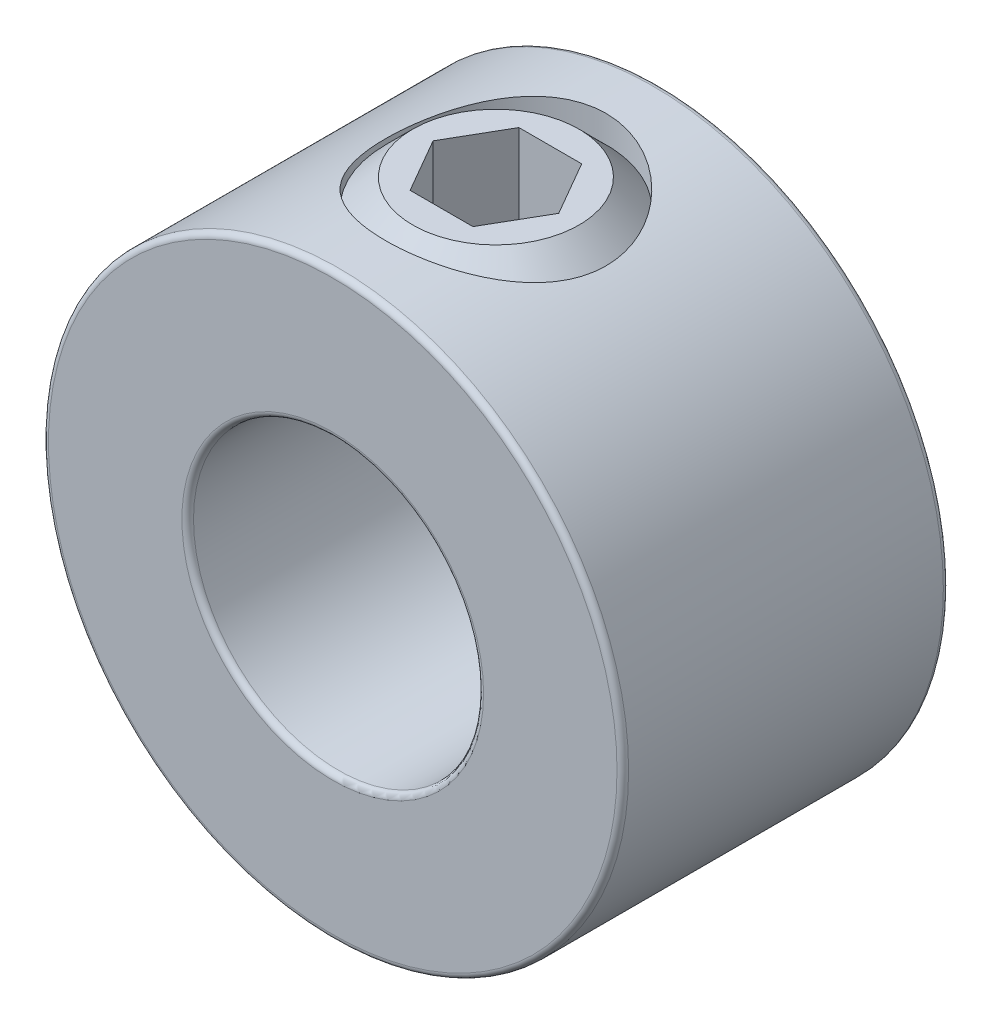
ISO-10303-21;
HEADER;
FILE_DESCRIPTION(('STEP AP214'),'2;1');
FILE_NAME('part.step','',(''),(''),'','','');
FILE_SCHEMA(('AUTOMOTIVE_DESIGN { 1 0 10303 214 1 1 1 1 }'));
ENDSEC;
DATA;
#1=APPLICATION_CONTEXT('core data for automotive mechanical design processes');
#2=APPLICATION_PROTOCOL_DEFINITION('international standard','automotive_design',2000,#1);
#3=PRODUCT_CONTEXT('',#1,'mechanical');
#4=PRODUCT('Part','Part','',(#3));
#5=PRODUCT_RELATED_PRODUCT_CATEGORY('part','',(#4));
#6=PRODUCT_DEFINITION_FORMATION('','',#4);
#7=PRODUCT_DEFINITION_CONTEXT('part definition',#1,'design');
#8=PRODUCT_DEFINITION('design','',#6,#7);
#9=PRODUCT_DEFINITION_SHAPE('','',#8);
#10=(LENGTH_UNIT() NAMED_UNIT(*) SI_UNIT(.MILLI.,.METRE.));
#11=(NAMED_UNIT(*) PLANE_ANGLE_UNIT() SI_UNIT($,.RADIAN.));
#12=(NAMED_UNIT(*) SI_UNIT($,.STERADIAN.) SOLID_ANGLE_UNIT());
#13=UNCERTAINTY_MEASURE_WITH_UNIT(LENGTH_MEASURE(1.E-05),#10,'distance_accuracy_value','');
#14=(GEOMETRIC_REPRESENTATION_CONTEXT(3) GLOBAL_UNCERTAINTY_ASSIGNED_CONTEXT((#13)) GLOBAL_UNIT_ASSIGNED_CONTEXT((#10,
#11,#12)) REPRESENTATION_CONTEXT('',''));
#15=CARTESIAN_POINT('',(0.,0.,0.));
#16=DIRECTION('',(0.,0.,1.));
#17=DIRECTION('',(1.,0.,0.));
#18=AXIS2_PLACEMENT_3D('',#15,#16,#17);
#19=CARTESIAN_POINT('',(0.,6.35,0.));
#20=DIRECTION('',(0.,1.,0.));
#21=DIRECTION('',(-1.,0.,0.));
#22=AXIS2_PLACEMENT_3D('',#19,#20,#21);
#23=PLANE('',#22);
#24=CARTESIAN_POINT('',(0.,6.35,0.));
#25=DIRECTION('',(0.,1.,0.));
#26=DIRECTION('',(-1.,0.,0.));
#27=AXIS2_PLACEMENT_3D('',#24,#25,#26);
#28=CIRCLE('',#27,1.81975161629017);
#29=CARTESIAN_POINT('',(-1.81975161629017,6.35,0.));
#30=VERTEX_POINT('',#29);
#31=EDGE_CURVE('E12',#30,#30,#28,.T.);
#32=ORIENTED_EDGE('',*,*,#31,.T.);
#33=EDGE_LOOP('',(#32));
#34=FACE_BOUND('',#33,.T.);
#35=DIRECTION('',(1.,0.,0.));
#36=VECTOR('',#35,1.);
#37=CARTESIAN_POINT('',(-0.687407664253899,6.34999999999999,-1.190625));
#38=LINE('',#37,#36);
#39=CARTESIAN_POINT('',(-0.687407664253899,6.34999999999999,-1.190625));
#40=VERTEX_POINT('',#39);
#41=CARTESIAN_POINT('',(0.687407664253899,6.35,-1.190625));
#42=VERTEX_POINT('',#41);
#43=EDGE_CURVE('E112',#40,#42,#38,.T.);
#44=ORIENTED_EDGE('',*,*,#43,.T.);
#45=DIRECTION('',(0.5,0.,0.866025403784439));
#46=VECTOR('',#45,1.);
#47=CARTESIAN_POINT('',(0.687407664253899,6.34999999999999,-1.190625));
#48=LINE('',#47,#46);
#49=CARTESIAN_POINT('',(1.3748153285078,6.34999999999999,0.));
#50=VERTEX_POINT('',#49);
#51=EDGE_CURVE('E58',#42,#50,#48,.T.);
#52=ORIENTED_EDGE('',*,*,#51,.T.);
#53=DIRECTION('',(-0.5,0.,0.866025403784439));
#54=VECTOR('',#53,1.);
#55=CARTESIAN_POINT('',(1.3748153285078,6.34999999999999,0.));
#56=LINE('',#55,#54);
#57=CARTESIAN_POINT('',(0.687407664253899,6.34999999999999,1.190625));
#58=VERTEX_POINT('',#57);
#59=EDGE_CURVE('E116',#50,#58,#56,.T.);
#60=ORIENTED_EDGE('',*,*,#59,.T.);
#61=DIRECTION('',(-1.,0.,0.));
#62=VECTOR('',#61,1.);
#63=CARTESIAN_POINT('',(0.687407664253899,6.34999999999999,1.190625));
#64=LINE('',#63,#62);
#65=CARTESIAN_POINT('',(-0.687407664253899,6.34999999999999,1.190625));
#66=VERTEX_POINT('',#65);
#67=EDGE_CURVE('E179',#58,#66,#64,.T.);
#68=ORIENTED_EDGE('',*,*,#67,.T.);
#69=DIRECTION('',(-0.5,0.,-0.866025403784439));
#70=VECTOR('',#69,1.);
#71=CARTESIAN_POINT('',(-0.687407664253899,6.34999999999999,1.190625));
#72=LINE('',#71,#70);
#73=CARTESIAN_POINT('',(-1.3748153285078,6.34999999999999,0.));
#74=VERTEX_POINT('',#73);
#75=EDGE_CURVE('E164',#66,#74,#72,.T.);
#76=ORIENTED_EDGE('',*,*,#75,.T.);
#77=DIRECTION('',(0.5,0.,-0.866025403784439));
#78=VECTOR('',#77,1.);
#79=CARTESIAN_POINT('',(-1.3748153285078,6.34999999999999,0.));
#80=LINE('',#79,#78);
#81=EDGE_CURVE('E160',#74,#40,#80,.T.);
#82=ORIENTED_EDGE('',*,*,#81,.T.);
#83=EDGE_LOOP('',(#44,#52,#60,#68,#76,#82));
#84=FACE_BOUND('',#83,.T.);
#85=ADVANCED_FACE('F44',(#34,#84),#23,.T.);
#86=CARTESIAN_POINT('',(0.,6.35,0.));
#87=DIRECTION('',(0.,-1.,0.));
#88=DIRECTION('',(1.,0.,0.));
#89=AXIS2_PLACEMENT_3D('',#86,#87,#88);
#90=CONICAL_SURFACE('',#89,1.81975161629017,0.785398163397449);
#91=CARTESIAN_POINT('',(0.,5.75675161629017,0.));
#92=DIRECTION('',(0.,1.,0.));
#93=DIRECTION('',(-1.,0.,0.));
#94=AXIS2_PLACEMENT_3D('',#91,#92,#93);
#95=CIRCLE('',#94,2.413);
#96=CARTESIAN_POINT('',(-2.413,5.75675161629017,0.));
#97=VERTEX_POINT('',#96);
#98=EDGE_CURVE('E51',#97,#97,#95,.T.);
#99=ORIENTED_EDGE('',*,*,#98,.T.);
#100=EDGE_LOOP('',(#99));
#101=FACE_BOUND('',#100,.T.);
#102=ORIENTED_EDGE('',*,*,#31,.F.);
#103=EDGE_LOOP('',(#102));
#104=FACE_BOUND('',#103,.T.);
#105=ADVANCED_FACE('F134',(#101,#104),#90,.T.);
#106=CARTESIAN_POINT('',(0.,3.175,0.));
#107=DIRECTION('',(0.,1.,0.));
#108=DIRECTION('',(-1.,0.,0.));
#109=AXIS2_PLACEMENT_3D('',#106,#107,#108);
#110=CYLINDRICAL_SURFACE('',#109,2.413);
#111=CARTESIAN_POINT('',(0.,3.76824838370983,0.));
#112=DIRECTION('',(0.,1.,0.));
#113=DIRECTION('',(-1.,0.,0.));
#114=AXIS2_PLACEMENT_3D('',#111,#112,#113);
#115=CIRCLE('',#114,2.413);
#116=CARTESIAN_POINT('',(-2.413,3.76824838370983,0.));
#117=VERTEX_POINT('',#116);
#118=EDGE_CURVE('E129',#117,#117,#115,.T.);
#119=ORIENTED_EDGE('',*,*,#118,.T.);
#120=EDGE_LOOP('',(#119));
#121=FACE_BOUND('',#120,.T.);
#122=ORIENTED_EDGE('',*,*,#98,.F.);
#123=EDGE_LOOP('',(#122));
#124=FACE_BOUND('',#123,.T.);
#125=ADVANCED_FACE('F137',(#121,#124),#110,.T.);
#126=CARTESIAN_POINT('',(0.,3.76824838370983,0.));
#127=DIRECTION('',(0.,1.,0.));
#128=DIRECTION('',(-1.,0.,0.));
#129=AXIS2_PLACEMENT_3D('',#126,#127,#128);
#130=CONICAL_SURFACE('',#129,2.413,0.785398163397448);
#131=CARTESIAN_POINT('',(0.,3.175,0.));
#132=DIRECTION('',(0.,1.,0.));
#133=DIRECTION('',(-1.,0.,0.));
#134=AXIS2_PLACEMENT_3D('',#131,#132,#133);
#135=CIRCLE('',#134,1.81975161629017);
#136=CARTESIAN_POINT('',(-1.81975161629017,3.175,0.));
#137=VERTEX_POINT('',#136);
#138=EDGE_CURVE('E121',#137,#137,#135,.T.);
#139=ORIENTED_EDGE('',*,*,#138,.T.);
#140=EDGE_LOOP('',(#139));
#141=FACE_BOUND('',#140,.T.);
#142=ORIENTED_EDGE('',*,*,#118,.F.);
#143=EDGE_LOOP('',(#142));
#144=FACE_BOUND('',#143,.T.);
#145=ADVANCED_FACE('F139',(#141,#144),#130,.T.);
#146=CARTESIAN_POINT('',(-1.81975161629017,3.175,0.));
#147=DIRECTION('',(0.,-1.,0.));
#148=DIRECTION('',(1.,0.,0.));
#149=AXIS2_PLACEMENT_3D('',#146,#147,#148);
#150=PLANE('',#149);
#151=CARTESIAN_POINT('',(0.,3.175,0.));
#152=DIRECTION('',(0.,1.,0.));
#153=DIRECTION('',(-1.,0.,0.));
#154=AXIS2_PLACEMENT_3D('',#151,#152,#153);
#155=CIRCLE('',#154,0.711898060451796);
#156=CARTESIAN_POINT('',(-0.711898060451796,3.175,0.));
#157=VERTEX_POINT('',#156);
#158=EDGE_CURVE('E117',#157,#157,#155,.T.);
#159=ORIENTED_EDGE('',*,*,#158,.T.);
#160=EDGE_LOOP('',(#159));
#161=FACE_BOUND('',#160,.T.);
#162=ORIENTED_EDGE('',*,*,#138,.F.);
#163=EDGE_LOOP('',(#162));
#164=FACE_BOUND('',#163,.T.);
#165=ADVANCED_FACE('F146',(#161,#164),#150,.T.);
#166=CARTESIAN_POINT('',(0.,3.175,0.));
#167=DIRECTION('',(0.,-1.,0.));
#168=DIRECTION('',(1.,0.,0.));
#169=AXIS2_PLACEMENT_3D('',#166,#167,#168);
#170=CONICAL_SURFACE('',#169,0.711898060451796,0.785398163397448);
#171=CARTESIAN_POINT('',(0.,3.8868980604518,0.));
#172=VERTEX_POINT('',#171);
#173=VERTEX_LOOP('',#172);
#174=FACE_BOUND('',#173,.T.);
#175=ORIENTED_EDGE('',*,*,#158,.F.);
#176=EDGE_LOOP('',(#175));
#177=FACE_BOUND('',#176,.T.);
#178=ADVANCED_FACE('F213',(#174,#177),#170,.F.);
#179=CARTESIAN_POINT('',(0.687407664253899,3.96874999999999,-1.190625));
#180=DIRECTION('',(-0.866025403784439,0.,0.5));
#181=DIRECTION('',(0.5,0.,0.866025403784438));
#182=AXIS2_PLACEMENT_3D('',#179,#180,#181);
#183=PLANE('',#182);
#184=ORIENTED_EDGE('',*,*,#51,.F.);
#185=DIRECTION('',(0.,1.,0.));
#186=VECTOR('',#185,1.);
#187=CARTESIAN_POINT('',(0.687407664253899,3.96874999999999,-1.190625));
#188=LINE('',#187,#186);
#189=CARTESIAN_POINT('',(0.687407664253899,3.96874999999999,-1.190625));
#190=VERTEX_POINT('',#189);
#191=EDGE_CURVE('E111',#190,#42,#188,.T.);
#192=ORIENTED_EDGE('',*,*,#191,.F.);
#193=DIRECTION('',(0.5,0.,0.866025403784439));
#194=VECTOR('',#193,1.);
#195=CARTESIAN_POINT('',(0.687407664253899,3.96874999999999,-1.190625));
#196=LINE('',#195,#194);
#197=CARTESIAN_POINT('',(1.3748153285078,3.96874999999999,0.));
#198=VERTEX_POINT('',#197);
#199=EDGE_CURVE('E102',#190,#198,#196,.T.);
#200=ORIENTED_EDGE('',*,*,#199,.T.);
#201=DIRECTION('',(0.,1.,0.));
#202=VECTOR('',#201,1.);
#203=CARTESIAN_POINT('',(1.3748153285078,3.96874999999999,0.));
#204=LINE('',#203,#202);
#205=EDGE_CURVE('E110',#198,#50,#204,.T.);
#206=ORIENTED_EDGE('',*,*,#205,.T.);
#207=EDGE_LOOP('',(#184,#192,#200,#206));
#208=FACE_BOUND('',#207,.T.);
#209=ADVANCED_FACE('F109',(#208),#183,.T.);
#210=CARTESIAN_POINT('',(1.3748153285078,3.96874999999999,0.));
#211=DIRECTION('',(-0.866025403784439,0.,-0.5));
#212=DIRECTION('',(-0.5,0.,0.866025403784439));
#213=AXIS2_PLACEMENT_3D('',#210,#211,#212);
#214=PLANE('',#213);
#215=ORIENTED_EDGE('',*,*,#59,.F.);
#216=ORIENTED_EDGE('',*,*,#205,.F.);
#217=DIRECTION('',(-0.5,0.,0.866025403784439));
#218=VECTOR('',#217,1.);
#219=CARTESIAN_POINT('',(1.3748153285078,3.96874999999999,0.));
#220=LINE('',#219,#218);
#221=CARTESIAN_POINT('',(0.687407664253899,3.96874999999999,1.190625));
#222=VERTEX_POINT('',#221);
#223=EDGE_CURVE('E98',#198,#222,#220,.T.);
#224=ORIENTED_EDGE('',*,*,#223,.T.);
#225=DIRECTION('',(0.,1.,0.));
#226=VECTOR('',#225,1.);
#227=CARTESIAN_POINT('',(0.687407664253899,3.96874999999999,1.190625));
#228=LINE('',#227,#226);
#229=EDGE_CURVE('E118',#222,#58,#228,.T.);
#230=ORIENTED_EDGE('',*,*,#229,.T.);
#231=EDGE_LOOP('',(#215,#216,#224,#230));
#232=FACE_BOUND('',#231,.T.);
#233=ADVANCED_FACE('F114',(#232),#214,.T.);
#234=CARTESIAN_POINT('',(0.687407664253899,3.96874999999999,1.190625));
#235=DIRECTION('',(0.,0.,-1.));
#236=DIRECTION('',(-1.,0.,0.));
#237=AXIS2_PLACEMENT_3D('',#234,#235,#236);
#238=PLANE('',#237);
#239=ORIENTED_EDGE('',*,*,#67,.F.);
#240=ORIENTED_EDGE('',*,*,#229,.F.);
#241=DIRECTION('',(-1.,0.,0.));
#242=VECTOR('',#241,1.);
#243=CARTESIAN_POINT('',(0.687407664253899,3.96874999999999,1.190625));
#244=LINE('',#243,#242);
#245=CARTESIAN_POINT('',(-0.687407664253899,3.96874999999999,1.190625));
#246=VERTEX_POINT('',#245);
#247=EDGE_CURVE('E104',#222,#246,#244,.T.);
#248=ORIENTED_EDGE('',*,*,#247,.T.);
#249=DIRECTION('',(0.,1.,0.));
#250=VECTOR('',#249,1.);
#251=CARTESIAN_POINT('',(-0.687407664253899,3.96874999999999,1.190625));
#252=LINE('',#251,#250);
#253=EDGE_CURVE('E123',#246,#66,#252,.T.);
#254=ORIENTED_EDGE('',*,*,#253,.T.);
#255=EDGE_LOOP('',(#239,#240,#248,#254));
#256=FACE_BOUND('',#255,.T.);
#257=ADVANCED_FACE('F177',(#256),#238,.T.);
#258=CARTESIAN_POINT('',(-0.687407664253899,3.96874999999999,1.190625));
#259=DIRECTION('',(0.866025403784439,0.,-0.5));
#260=DIRECTION('',(-0.5,0.,-0.866025403784438));
#261=AXIS2_PLACEMENT_3D('',#258,#259,#260);
#262=PLANE('',#261);
#263=ORIENTED_EDGE('',*,*,#75,.F.);
#264=ORIENTED_EDGE('',*,*,#253,.F.);
#265=DIRECTION('',(-0.5,0.,-0.866025403784439));
#266=VECTOR('',#265,1.);
#267=CARTESIAN_POINT('',(-0.687407664253899,3.96874999999999,1.190625));
#268=LINE('',#267,#266);
#269=CARTESIAN_POINT('',(-1.3748153285078,3.96874999999999,0.));
#270=VERTEX_POINT('',#269);
#271=EDGE_CURVE('E190',#246,#270,#268,.T.);
#272=ORIENTED_EDGE('',*,*,#271,.T.);
#273=DIRECTION('',(0.,1.,0.));
#274=VECTOR('',#273,1.);
#275=CARTESIAN_POINT('',(-1.3748153285078,3.96874999999999,0.));
#276=LINE('',#275,#274);
#277=EDGE_CURVE('E172',#270,#74,#276,.T.);
#278=ORIENTED_EDGE('',*,*,#277,.T.);
#279=EDGE_LOOP('',(#263,#264,#272,#278));
#280=FACE_BOUND('',#279,.T.);
#281=ADVANCED_FACE('F181',(#280),#262,.T.);
#282=CARTESIAN_POINT('',(-1.3748153285078,3.96874999999999,0.));
#283=DIRECTION('',(0.866025403784439,0.,0.5));
#284=DIRECTION('',(0.5,0.,-0.866025403784439));
#285=AXIS2_PLACEMENT_3D('',#282,#283,#284);
#286=PLANE('',#285);
#287=ORIENTED_EDGE('',*,*,#81,.F.);
#288=ORIENTED_EDGE('',*,*,#277,.F.);
#289=DIRECTION('',(0.5,0.,-0.866025403784439));
#290=VECTOR('',#289,1.);
#291=CARTESIAN_POINT('',(-1.3748153285078,3.96874999999999,0.));
#292=LINE('',#291,#290);
#293=CARTESIAN_POINT('',(-0.687407664253899,3.96874999999999,-1.190625));
#294=VERTEX_POINT('',#293);
#295=EDGE_CURVE('E188',#270,#294,#292,.T.);
#296=ORIENTED_EDGE('',*,*,#295,.T.);
#297=DIRECTION('',(0.,1.,0.));
#298=VECTOR('',#297,1.);
#299=CARTESIAN_POINT('',(-0.687407664253899,3.96874999999999,-1.190625));
#300=LINE('',#299,#298);
#301=EDGE_CURVE('E169',#294,#40,#300,.T.);
#302=ORIENTED_EDGE('',*,*,#301,.T.);
#303=EDGE_LOOP('',(#287,#288,#296,#302));
#304=FACE_BOUND('',#303,.T.);
#305=ADVANCED_FACE('F194',(#304),#286,.T.);
#306=CARTESIAN_POINT('',(-0.687407664253899,3.96874999999999,-1.190625));
#307=DIRECTION('',(0.,0.,1.));
#308=DIRECTION('',(1.,0.,0.));
#309=AXIS2_PLACEMENT_3D('',#306,#307,#308);
#310=PLANE('',#309);
#311=ORIENTED_EDGE('',*,*,#43,.F.);
#312=ORIENTED_EDGE('',*,*,#301,.F.);
#313=DIRECTION('',(1.,0.,0.));
#314=VECTOR('',#313,1.);
#315=CARTESIAN_POINT('',(-0.687407664253899,3.96874999999999,-1.190625));
#316=LINE('',#315,#314);
#317=EDGE_CURVE('E170',#294,#190,#316,.T.);
#318=ORIENTED_EDGE('',*,*,#317,.T.);
#319=ORIENTED_EDGE('',*,*,#191,.T.);
#320=EDGE_LOOP('',(#311,#312,#318,#319));
#321=FACE_BOUND('',#320,.T.);
#322=ADVANCED_FACE('F195',(#321),#310,.T.);
#323=CARTESIAN_POINT('',(1.3748153285078,3.96874999999999,0.));
#324=DIRECTION('',(0.,-1.,0.));
#325=DIRECTION('',(0.,0.,-1.));
#326=AXIS2_PLACEMENT_3D('',#323,#324,#325);
#327=PLANE('',#326);
#328=ORIENTED_EDGE('',*,*,#199,.F.);
#329=ORIENTED_EDGE('',*,*,#317,.F.);
#330=ORIENTED_EDGE('',*,*,#295,.F.);
#331=ORIENTED_EDGE('',*,*,#271,.F.);
#332=ORIENTED_EDGE('',*,*,#247,.F.);
#333=ORIENTED_EDGE('',*,*,#223,.F.);
#334=EDGE_LOOP('',(#328,#329,#330,#331,#332,#333));
#335=FACE_BOUND('',#334,.T.);
#336=ADVANCED_FACE('F100',(#335),#327,.F.);
#337=CLOSED_SHELL('',(#85,#105,#125,#145,#165,#178,#209,#233,#257,#281,#305,#322,#336));
#338=MANIFOLD_SOLID_BREP('B2',#337);
#339=CARTESIAN_POINT('',(0.,0.,3.571875));
#340=DIRECTION('',(0.,0.,1.));
#341=DIRECTION('',(1.,0.,0.));
#342=AXIS2_PLACEMENT_3D('',#339,#340,#341);
#343=PLANE('',#342);
#344=CARTESIAN_POINT('',(0.,0.,3.571875));
#345=DIRECTION('',(0.,0.,1.));
#346=DIRECTION('',(1.,0.,0.));
#347=AXIS2_PLACEMENT_3D('',#344,#345,#346);
#348=CIRCLE('',#347,3.302);
#349=CARTESIAN_POINT('',(3.302,0.,3.571875));
#350=VERTEX_POINT('',#349);
#351=EDGE_CURVE('E309',#350,#350,#348,.F.);
#352=ORIENTED_EDGE('',*,*,#351,.T.);
#353=EDGE_LOOP('',(#352));
#354=FACE_BOUND('',#353,.T.);
#355=CARTESIAN_POINT('',(0.,0.,3.571875));
#356=DIRECTION('',(0.,0.,1.));
#357=DIRECTION('',(1.,0.,0.));
#358=AXIS2_PLACEMENT_3D('',#355,#356,#357);
#359=CIRCLE('',#358,6.223);
#360=CARTESIAN_POINT('',(6.223,0.,3.571875));
#361=VERTEX_POINT('',#360);
#362=EDGE_CURVE('E313',#361,#361,#359,.T.);
#363=ORIENTED_EDGE('',*,*,#362,.T.);
#364=EDGE_LOOP('',(#363));
#365=FACE_BOUND('',#364,.T.);
#366=ADVANCED_FACE('F298',(#354,#365),#343,.T.);
#367=CARTESIAN_POINT('',(0.,0.,-3.571875));
#368=DIRECTION('',(0.,0.,1.));
#369=DIRECTION('',(1.,0.,0.));
#370=AXIS2_PLACEMENT_3D('',#367,#368,#369);
#371=PLANE('',#370);
#372=CARTESIAN_POINT('',(0.,0.,-3.571875));
#373=DIRECTION('',(0.,0.,1.));
#374=DIRECTION('',(1.,0.,0.));
#375=AXIS2_PLACEMENT_3D('',#372,#373,#374);
#376=CIRCLE('',#375,3.302);
#377=CARTESIAN_POINT('',(3.302,0.,-3.571875));
#378=VERTEX_POINT('',#377);
#379=EDGE_CURVE('E324',#378,#378,#376,.T.);
#380=ORIENTED_EDGE('',*,*,#379,.T.);
#381=EDGE_LOOP('',(#380));
#382=FACE_BOUND('',#381,.T.);
#383=CARTESIAN_POINT('',(0.,0.,-3.571875));
#384=DIRECTION('',(0.,0.,1.));
#385=DIRECTION('',(1.,0.,0.));
#386=AXIS2_PLACEMENT_3D('',#383,#384,#385);
#387=CIRCLE('',#386,6.223);
#388=CARTESIAN_POINT('',(6.223,0.,-3.571875));
#389=VERTEX_POINT('',#388);
#390=EDGE_CURVE('E327',#389,#389,#387,.F.);
#391=ORIENTED_EDGE('',*,*,#390,.T.);
#392=EDGE_LOOP('',(#391));
#393=FACE_BOUND('',#392,.T.);
#394=ADVANCED_FACE('F363',(#382,#393),#371,.F.);
#395=CARTESIAN_POINT('',(0.,0.,3.571875));
#396=DIRECTION('',(0.,0.,-1.));
#397=DIRECTION('',(-1.,0.,0.));
#398=AXIS2_PLACEMENT_3D('',#395,#396,#397);
#399=CYLINDRICAL_SURFACE('',#398,6.35);
#400=CARTESIAN_POINT('',(0.,0.,-3.444875));
#401=DIRECTION('',(0.,0.,1.));
#402=DIRECTION('',(1.,0.,0.));
#403=AXIS2_PLACEMENT_3D('',#400,#401,#402);
#404=CIRCLE('',#403,6.35);
#405=CARTESIAN_POINT('',(6.35,0.,-3.444875));
#406=VERTEX_POINT('',#405);
#407=EDGE_CURVE('E43',#406,#406,#404,.T.);
#408=ORIENTED_EDGE('',*,*,#407,.T.);
#409=EDGE_LOOP('',(#408));
#410=FACE_BOUND('',#409,.T.);
#411=CARTESIAN_POINT('',(0.,0.,3.444875));
#412=DIRECTION('',(0.,0.,1.));
#413=DIRECTION('',(1.,0.,0.));
#414=AXIS2_PLACEMENT_3D('',#411,#412,#413);
#415=CIRCLE('',#414,6.35);
#416=CARTESIAN_POINT('',(6.35,0.,3.444875));
#417=VERTEX_POINT('',#416);
#418=EDGE_CURVE('E305',#417,#417,#415,.F.);
#419=ORIENTED_EDGE('',*,*,#418,.T.);
#420=EDGE_LOOP('',(#419));
#421=FACE_BOUND('',#420,.T.);
#422=CARTESIAN_POINT('',(0.,6.35,-2.413));
#423=CARTESIAN_POINT('',(0.130555931467962,6.35000398969011,-2.41300527534602));
#424=CARTESIAN_POINT('',(0.261076241377739,6.34593890816647,-2.4023714543113));
#425=CARTESIAN_POINT('',(0.518209446534913,6.33012963929965,-2.36029479676423));
#426=CARTESIAN_POINT('',(0.644823015088655,6.31838678300935,-2.32885556715778));
#427=CARTESIAN_POINT('',(0.890396734122701,6.28848040494,-2.24644511602075));
#428=CARTESIAN_POINT('',(1.00937135935963,6.27032947705095,-2.19551218938446));
#429=CARTESIAN_POINT('',(1.23707694907279,6.22940932060409,-2.07575764561934));
#430=CARTESIAN_POINT('',(1.34580507871092,6.20663881943741,-2.00693109764769));
#431=CARTESIAN_POINT('',(1.5546544090621,6.15771932779737,-1.85022277092613));
#432=CARTESIAN_POINT('',(1.65427192875035,6.13147296383124,-1.76170041624995));
#433=CARTESIAN_POINT('',(1.83765571561736,6.07903240405007,-1.56947315042905));
#434=CARTESIAN_POINT('',(1.92141693988139,6.05283822744466,-1.46576342765122));
#435=CARTESIAN_POINT('',(2.07395660623911,6.00232668170519,-1.24113386470124));
#436=CARTESIAN_POINT('',(2.14201618015845,5.97812365120729,-1.11969756154783));
#437=CARTESIAN_POINT('',(2.25652093858858,5.93585432476053,-0.866038380432351));
#438=CARTESIAN_POINT('',(2.30297502037546,5.91778550353544,-0.733819969020803));
#439=CARTESIAN_POINT('',(2.37094947712185,5.89087364983883,-0.46815363189803));
#440=CARTESIAN_POINT('',(2.39343294050412,5.88167580744491,-0.334989300795486));
#441=CARTESIAN_POINT('',(2.41583880524757,5.87251090464605,-0.0664845962936197));
#442=CARTESIAN_POINT('',(2.41577084821779,5.87253989940926,0.0688548224232351));
#443=CARTESIAN_POINT('',(2.39381090108878,5.88152011871453,0.328972227003014));
#444=CARTESIAN_POINT('',(2.37326609797153,5.88992057372023,0.453886522563246));
#445=CARTESIAN_POINT('',(2.31316652422954,5.91378008823147,0.698339704990829));
#446=CARTESIAN_POINT('',(2.27360881167116,5.92924024008996,0.817877756841903));
#447=CARTESIAN_POINT('',(2.17588364092748,5.96580146890692,1.0508916152852));
#448=CARTESIAN_POINT('',(2.11737290423754,5.98700531598431,1.16420661484106));
#449=CARTESIAN_POINT('',(1.98364217411328,6.03263175509447,1.37979639920587));
#450=CARTESIAN_POINT('',(1.90841630395244,6.05705547794376,1.4820672822727));
#451=CARTESIAN_POINT('',(1.73726689770536,6.10842961274997,1.68010694238863));
#452=CARTESIAN_POINT('',(1.64027173491613,6.13543795015635,1.77493688260015));
#453=CARTESIAN_POINT('',(1.43144868882472,6.18748920351012,1.94726806056401));
#454=CARTESIAN_POINT('',(1.31961840653187,6.2125318005324,2.02476649017818));
#455=CARTESIAN_POINT('',(1.08185265975391,6.25835188225341,2.16130771487283));
#456=CARTESIAN_POINT('',(0.955717417234618,6.27905339803369,2.22002994310971));
#457=CARTESIAN_POINT('',(0.694375189035109,6.31329326294077,2.31510736575226));
#458=CARTESIAN_POINT('',(0.559172376611221,6.32683488218724,2.3514727723643));
#459=CARTESIAN_POINT('',(0.291428150212525,6.3446501972992,2.39898109857718));
#460=CARTESIAN_POINT('',(0.159141645079808,6.34938771868047,2.41138775288999));
#461=CARTESIAN_POINT('',(-0.105693065348276,6.35049981057155,2.41431626348443));
#462=CARTESIAN_POINT('',(-0.238241203822052,6.34687629478166,2.40484312768025));
#463=CARTESIAN_POINT('',(-0.494323602805378,6.33197908606406,2.36523562382545));
#464=CARTESIAN_POINT('',(-0.61800684441211,6.32101461634214,2.33593589818825));
#465=CARTESIAN_POINT('',(-0.858609565436108,6.29285092848222,2.25861304376362));
#466=CARTESIAN_POINT('',(-0.975528163914414,6.27565090041604,2.21058748264173));
#467=CARTESIAN_POINT('',(-1.20317276582384,6.23607457125026,2.09563503714011));
#468=CARTESIAN_POINT('',(-1.3136121499673,6.21355984396609,2.02818967610491));
#469=CARTESIAN_POINT('',(-1.52197988578177,6.16583504517286,1.87689595883598));
#470=CARTESIAN_POINT('',(-1.61990351002366,6.14062396176678,1.79304143465584));
#471=CARTESIAN_POINT('',(-1.80656807112922,6.08841217199752,1.60543272496061));
#472=CARTESIAN_POINT('',(-1.89441393314817,6.06139435477813,1.5007904098217));
#473=CARTESIAN_POINT('',(-2.05148411432654,6.01005496187559,1.27772800811267));
#474=CARTESIAN_POINT('',(-2.12070651399853,5.98573366426972,1.15930650314625));
#475=CARTESIAN_POINT('',(-2.23870023772464,5.94261798623815,0.910922748538602));
#476=CARTESIAN_POINT('',(-2.28736466342468,5.92385264334907,0.780904332023381));
#477=CARTESIAN_POINT('',(-2.36177800946808,5.89458517077402,0.513602694331982));
#478=CARTESIAN_POINT('',(-2.38754162954713,5.8840777409413,0.376324193363579));
#479=CARTESIAN_POINT('',(-2.41408994040532,5.87323215610138,0.108127165215383));
#480=CARTESIAN_POINT('',(-2.41640623148607,5.87227054588007,-0.0226157343841075));
#481=CARTESIAN_POINT('',(-2.3999373204655,5.8790202253426,-0.282524873396556));
#482=CARTESIAN_POINT('',(-2.38115423316032,5.88673064582666,-0.41169126951125));
#483=CARTESIAN_POINT('',(-2.32422421188573,5.90943043237583,-0.660552265849344));
#484=CARTESIAN_POINT('',(-2.28672002796391,5.92417751295514,-0.780417919491674));
#485=CARTESIAN_POINT('',(-2.19398528189399,5.95914188552999,-1.01222145618602));
#486=CARTESIAN_POINT('',(-2.13875018285588,5.97936057736356,-1.12415730124382));
#487=CARTESIAN_POINT('',(-2.00869997639504,6.02433337271119,-1.34342800575803));
#488=CARTESIAN_POINT('',(-1.93299650808671,6.04927206356278,-1.4501976241717));
#489=CARTESIAN_POINT('',(-1.76551836882645,6.10025417003155,-1.65000619367226));
#490=CARTESIAN_POINT('',(-1.67373852090438,6.12629793945648,-1.74304070389426));
#491=CARTESIAN_POINT('',(-1.47055494697206,6.17831294001547,-1.91807209951937));
#492=CARTESIAN_POINT('',(-1.35833856072122,6.20419794006484,-1.99915556641372));
#493=CARTESIAN_POINT('',(-1.12096041375387,6.25144642675378,-2.14129762074769));
#494=CARTESIAN_POINT('',(-0.995797050693124,6.27280935273315,-2.20235372565052));
#495=CARTESIAN_POINT('',(-0.728778395788011,6.30955475572144,-2.30499263616226));
#496=CARTESIAN_POINT('',(-0.58638469778337,6.32454657619379,-2.3453288052365));
#497=CARTESIAN_POINT('',(-0.295976705251577,6.34476431329028,-2.39932232882264));
#498=CARTESIAN_POINT('',(-0.147965475024477,6.34999547828747,-2.41299402119021));
#499=CARTESIAN_POINT('',(0.,6.35,-2.413));
#500=B_SPLINE_CURVE_WITH_KNOTS('',3,(#422,#423,#424,#425,#426,#427,#428,#429,#430,#431,#432,
#433,#434,#435,#436,#437,#438,#439,#440,#441,#442,#443,#444,#445,#446,#447,#448,#449,#450,#451,
#452,#453,#454,#455,#456,#457,#458,#459,#460,#461,#462,#463,#464,#465,#466,#467,#468,#469,#470,
#471,#472,#473,#474,#475,#476,#477,#478,#479,#480,#481,#482,#483,#484,#485,#486,#487,#488,#489,
#490,#491,#492,#493,#494,#495,#496,#497,#498,#499),.UNSPECIFIED.,.T.,.F.,(4,2,2,2,2,2,2,2,2,2,2,
2,2,2,2,2,2,2,2,2,2,2,2,2,2,2,2,2,2,2,2,2,2,2,2,2,2,2,4),(0.,0.391121887064184,
0.782175985486185,1.17246577830223,1.56286323524963,1.96854634212709,2.37435825594016,
2.79613130529395,3.21773051175688,3.62166628723491,4.02542936468621,4.40427313209371,
4.78317553819666,5.16936515238192,5.55569075901495,5.96873424705112,6.38184461005431,
6.80167192308661,7.22130732355892,7.61812936188612,8.01486058335588,8.39585156202364,
8.77689204483065,9.16923685274999,9.56172942118012,9.9776135359701,10.3935404987953,
10.8116043631128,11.2293996833676,11.6197130905881,12.0099873800853,12.3876994067832,
12.7655081575183,13.1635000328781,13.5616203073395,13.9821012344605,14.4026342635628,
14.8461505355472,15.2894282569131),.UNSPECIFIED.);
#501=CARTESIAN_POINT('',(0.,6.35,-2.413));
#502=VERTEX_POINT('',#501);
#503=EDGE_CURVE('E330',#502,#502,#500,.T.);
#504=ORIENTED_EDGE('',*,*,#503,.T.);
#505=EDGE_LOOP('',(#504));
#506=FACE_BOUND('',#505,.T.);
#507=ADVANCED_FACE('F359',(#410,#421,#506),#399,.T.);
#508=CARTESIAN_POINT('',(0.,0.,3.571875));
#509=DIRECTION('',(0.,0.,-1.));
#510=DIRECTION('',(-1.,0.,0.));
#511=AXIS2_PLACEMENT_3D('',#508,#509,#510);
#512=CYLINDRICAL_SURFACE('',#511,3.175);
#513=CARTESIAN_POINT('',(0.,0.,-3.444875));
#514=DIRECTION('',(0.,0.,1.));
#515=DIRECTION('',(1.,0.,0.));
#516=AXIS2_PLACEMENT_3D('',#513,#514,#515);
#517=CIRCLE('',#516,3.175);
#518=CARTESIAN_POINT('',(3.175,0.,-3.444875));
#519=VERTEX_POINT('',#518);
#520=EDGE_CURVE('E318',#519,#519,#517,.F.);
#521=ORIENTED_EDGE('',*,*,#520,.T.);
#522=EDGE_LOOP('',(#521));
#523=FACE_BOUND('',#522,.T.);
#524=CARTESIAN_POINT('',(0.,0.,3.444875));
#525=DIRECTION('',(0.,0.,1.));
#526=DIRECTION('',(1.,0.,0.));
#527=AXIS2_PLACEMENT_3D('',#524,#525,#526);
#528=CIRCLE('',#527,3.175);
#529=CARTESIAN_POINT('',(3.175,0.,3.444875));
#530=VERTEX_POINT('',#529);
#531=EDGE_CURVE('E321',#530,#530,#528,.T.);
#532=ORIENTED_EDGE('',*,*,#531,.T.);
#533=EDGE_LOOP('',(#532));
#534=FACE_BOUND('',#533,.T.);
#535=CARTESIAN_POINT('',(0.,3.175,-2.413));
#536=CARTESIAN_POINT('',(0.117443171605231,3.17499092904906,-2.41299058031907));
#537=CARTESIAN_POINT('',(0.23503818841931,3.16841692674332,-2.4043581847269));
#538=CARTESIAN_POINT('',(0.466484967913331,3.14271336140829,-2.37038175457781));
#539=CARTESIAN_POINT('',(0.580328596183407,3.12355818632314,-2.34500362950094));
#540=CARTESIAN_POINT('',(0.80033693546367,3.07452724978738,-2.27928432631256));
#541=CARTESIAN_POINT('',(0.906543039514099,3.04471549355359,-2.23903243487973));
#542=CARTESIAN_POINT('',(1.10997011785933,2.97659455342082,-2.14548015839209));
#543=CARTESIAN_POINT('',(1.20719255384311,2.93828675533249,-2.09218190121579));
#544=CARTESIAN_POINT('',(1.40022726688529,2.85170030734834,-1.96882085307546));
#545=CARTESIAN_POINT('',(1.49506365463583,2.80282512985173,-1.89765858122501));
#546=CARTESIAN_POINT('',(1.67223382567996,2.7008760546092,-1.7435641158176));
#547=CARTESIAN_POINT('',(1.75454859398162,2.64779595363648,-1.66061438438314));
#548=CARTESIAN_POINT('',(1.92203888294129,2.5296135351956,-1.46565859240837));
#549=CARTESIAN_POINT('',(2.00423140536036,2.4643124367144,-1.35120048467098));
#550=CARTESIAN_POINT('',(2.14857118710811,2.33951215894306,-1.10735736644856));
#551=CARTESIAN_POINT('',(2.21074385995913,2.28000569136514,-0.977991565717825));
#552=CARTESIAN_POINT('',(2.29462037317499,2.19490180220151,-0.752497308608559));
#553=CARTESIAN_POINT('',(2.32287346332998,2.16472241167552,-0.66055827907226));
#554=CARTESIAN_POINT('',(2.36849823013454,2.11470881226284,-0.47139038700259));
#555=CARTESIAN_POINT('',(2.38589523743028,2.09485053921884,-0.374174418255039));
#556=CARTESIAN_POINT('',(2.40870358471578,2.06860028206587,-0.175460476777278));
#557=CARTESIAN_POINT('',(2.4139959431512,2.06234200752845,-0.073929905731699));
#558=CARTESIAN_POINT('',(2.41169213967819,2.06503422028968,0.128798184800726));
#559=CARTESIAN_POINT('',(2.40409306334661,2.07398814667793,0.22999562379254));
#560=CARTESIAN_POINT('',(2.37836508518799,2.10340433920656,0.416917246134645));
#561=CARTESIAN_POINT('',(2.36156171265492,2.1224091464969,0.503073429560243));
#562=CARTESIAN_POINT('',(2.31942910669347,2.16837457604816,0.671064962974234));
#563=CARTESIAN_POINT('',(2.29409116468348,2.19534332114491,0.752895800354834));
#564=CARTESIAN_POINT('',(2.21702947004233,2.27376916611904,0.962631680289748));
#565=CARTESIAN_POINT('',(2.15880606368402,2.32983777456744,1.08642083974007));
#566=CARTESIAN_POINT('',(2.0240584670168,2.44783368287627,1.32063556736185));
#567=CARTESIAN_POINT('',(1.94748865288627,2.50977535205404,1.43102676980356));
#568=CARTESIAN_POINT('',(1.77457755480707,2.63500191833982,1.64086400526623));
#569=CARTESIAN_POINT('',(1.67772908569284,2.69827393808612,1.73990181478264));
#570=CARTESIAN_POINT('',(1.46641465679805,2.81868720555883,1.92133244794249));
#571=CARTESIAN_POINT('',(1.35198192561174,2.87583967861316,2.00375600179513));
#572=CARTESIAN_POINT('',(1.1302184691796,2.96897239724258,2.13504920976438));
#573=CARTESIAN_POINT('',(1.02573469648465,3.00691100546587,2.18732233798596));
#574=CARTESIAN_POINT('',(0.807524498934965,3.07269924184988,2.27691743542351));
#575=CARTESIAN_POINT('',(0.693803632023793,3.10055488265641,2.31424831636675));
#576=CARTESIAN_POINT('',(0.458986561176873,3.14392869528766,2.37204565582169));
#577=CARTESIAN_POINT('',(0.337846653718269,3.15936426972399,2.39239924216467));
#578=CARTESIAN_POINT('',(0.0929212408274502,3.17600778354888,2.41433718167044));
#579=CARTESIAN_POINT('',(-0.0308628412677098,3.17722319336241,2.41593138989231));
#580=CARTESIAN_POINT('',(-0.263113673769308,3.16598164725166,2.40112430213952));
#581=CARTESIAN_POINT('',(-0.371784896474092,3.15499411480433,2.38665711938384));
#582=CARTESIAN_POINT('',(-0.584657379974265,3.12256258934286,2.34361709819449));
#583=CARTESIAN_POINT('',(-0.688857782558675,3.10111659842469,2.31504156459624));
#584=CARTESIAN_POINT('',(-0.893151752270642,3.04866013703249,2.24429284461138));
#585=CARTESIAN_POINT('',(-0.993066473951875,3.01741404656932,2.20178337061745));
#586=CARTESIAN_POINT('',(-1.18427030490273,2.94762615076737,2.10512741976429));
#587=CARTESIAN_POINT('',(-1.27555811070553,2.90908324556455,2.05097918840424));
#588=CARTESIAN_POINT('',(-1.4629408219305,2.82008518778891,1.92283493337221));
#589=CARTESIAN_POINT('',(-1.55736336530955,2.76871323654288,1.84703979297132));
#590=CARTESIAN_POINT('',(-1.7330266340156,2.66229345480278,1.68334400808498));
#591=CARTESIAN_POINT('',(-1.81424018707203,2.60723836781931,1.59541908083344));
#592=CARTESIAN_POINT('',(-1.93310120506622,2.51929011373857,1.44596227809647));
#593=CARTESIAN_POINT('',(-1.97518148865632,2.48634042838264,1.38794003709871));
#594=CARTESIAN_POINT('',(-2.05424288960517,2.42143291492003,1.26799956797446));
#595=CARTESIAN_POINT('',(-2.09122218168265,2.38947544500995,1.2060799567393));
#596=CARTESIAN_POINT('',(-2.19405069763864,2.29677780916441,1.01470921513655));
#597=CARTESIAN_POINT('',(-2.25209423008379,2.2389759481709,0.879267670433414));
#598=CARTESIAN_POINT('',(-2.32600727289693,2.16148731453314,0.648667618119571));
#599=CARTESIAN_POINT('',(-2.34951337659766,2.13568591161393,0.557995127674168));
#600=CARTESIAN_POINT('',(-2.38597736286025,2.09487284834006,0.372275602812797));
#601=CARTESIAN_POINT('',(-2.39896041795918,2.0798354491901,0.277239585981548));
#602=CARTESIAN_POINT('',(-2.41347202601588,2.06298898322372,0.0843820043038626));
#603=CARTESIAN_POINT('',(-2.41491881071071,2.06127434940024,-0.0134545208329241));
#604=CARTESIAN_POINT('',(-2.40600289841214,2.07166816759277,-0.20788213648133));
#605=CARTESIAN_POINT('',(-2.39562846174622,2.08379036100337,-0.304471892411458));
#606=CARTESIAN_POINT('',(-2.36137219311358,2.12256830664758,-0.508834367656112));
#607=CARTESIAN_POINT('',(-2.33557340769404,2.15126142901359,-0.615881798172457));
#608=CARTESIAN_POINT('',(-2.27108364148613,2.21923176610734,-0.822515613730422));
#609=CARTESIAN_POINT('',(-2.2323592210675,2.25853638265596,-0.922081817130457));
#610=CARTESIAN_POINT('',(-2.12610942507655,2.35955877527054,-1.15053309693759));
#611=CARTESIAN_POINT('',(-2.05324191025264,2.42403799567888,-1.27569998264042));
#612=CARTESIAN_POINT('',(-1.88728411653423,2.55539518076956,-1.5104318596925));
#613=CARTESIAN_POINT('',(-1.79417076882036,2.62227580852244,-1.61997881541957));
#614=CARTESIAN_POINT('',(-1.58693666845894,2.75272337581287,-1.82362287315767));
#615=CARTESIAN_POINT('',(-1.47252844795802,2.81622750409905,-1.9174704362987));
#616=CARTESIAN_POINT('',(-1.22472214874906,2.93245405690648,-2.0844185884594));
#617=CARTESIAN_POINT('',(-1.09136873492959,2.9852011492147,-2.15756679766189));
#618=CARTESIAN_POINT('',(-0.848324156263042,3.06143310070406,-2.2616762509508));
#619=CARTESIAN_POINT('',(-0.742491250018576,3.08897584082985,-2.29871569194653));
#620=CARTESIAN_POINT('',(-0.524711420429954,3.13329848559572,-2.35794338327758));
#621=CARTESIAN_POINT('',(-0.412780537897338,3.1501052759874,-2.38016873825137));
#622=CARTESIAN_POINT('',(-0.249887399880881,3.16554486424948,-2.40054788675386));
#623=CARTESIAN_POINT('',(-0.200104041382905,3.16908209053624,-2.40520884201812));
#624=CARTESIAN_POINT('',(-0.10022305414221,3.17381185752955,-2.41143725628489));
#625=CARTESIAN_POINT('',(-0.0501253573366512,3.17500387152911,-2.41300402036888));
#626=CARTESIAN_POINT('',(0.,3.175,-2.413));
#627=B_SPLINE_CURVE_WITH_KNOTS('',3,(#535,#536,#537,#538,#539,#540,#541,#542,#543,#544,#545,
#546,#547,#548,#549,#550,#551,#552,#553,#554,#555,#556,#557,#558,#559,#560,#561,#562,#563,#564,
#565,#566,#567,#568,#569,#570,#571,#572,#573,#574,#575,#576,#577,#578,#579,#580,#581,#582,#583,
#584,#585,#586,#587,#588,#589,#590,#591,#592,#593,#594,#595,#596,#597,#598,#599,#600,#601,#602,
#603,#604,#605,#606,#607,#608,#609,#610,#611,#612,#613,#614,#615,#616,#617,#618,#619,#620,#621,
#622,#623,#624,#625,#626),.UNSPECIFIED.,.T.,.F.,(4,2,2,2,2,2,2,2,2,2,2,2,2,2,2,2,2,2,2,2,2,2,2,
2,2,2,2,2,2,2,2,2,2,2,2,2,2,2,2,2,2,2,2,2,2,4),(0.,0.352113770291782,0.704946585369681,
1.05569488379078,1.40638601280107,1.78976092813112,2.17371233600607,2.63773050853704,
3.10115730525324,3.40258553658297,3.70330778533679,4.00697348207613,4.31070783899934,
4.57916413533347,4.84789519559245,5.28900480236595,5.73122295780719,6.18621377116464,
6.64035513804427,7.00739894320242,7.37422351187941,7.74346787257931,8.11251824563582,
8.44151894934109,8.77058252746343,9.10825790412116,9.44598421987268,9.83917081589853,
10.2331562784928,10.469557715449,10.7060435254032,11.1774135342105,11.4679029980311,
11.757695504225,12.0495402292483,12.3416750384965,12.6811651199407,13.0215403855346,
13.4947220530831,13.9684457327182,14.4491015240246,14.9286423754468,15.2736416515379,
15.6177735325977,15.768023783139,15.9183077742625),.UNSPECIFIED.);
#628=CARTESIAN_POINT('',(0.,3.175,-2.413));
#629=VERTEX_POINT('',#628);
#630=EDGE_CURVE('E331',#629,#629,#627,.T.);
#631=ORIENTED_EDGE('',*,*,#630,.F.);
#632=EDGE_LOOP('',(#631));
#633=FACE_BOUND('',#632,.T.);
#634=ADVANCED_FACE('F343',(#523,#534,#633),#512,.F.);
#635=CARTESIAN_POINT('',(0.,6.35,0.));
#636=DIRECTION('',(0.,-1.,0.));
#637=DIRECTION('',(0.,0.,-1.));
#638=AXIS2_PLACEMENT_3D('',#635,#636,#637);
#639=CYLINDRICAL_SURFACE('',#638,2.413);
#640=ORIENTED_EDGE('',*,*,#630,.T.);
#641=EDGE_LOOP('',(#640));
#642=FACE_BOUND('',#641,.T.);
#643=ORIENTED_EDGE('',*,*,#503,.F.);
#644=EDGE_LOOP('',(#643));
#645=FACE_BOUND('',#644,.T.);
#646=ADVANCED_FACE('F346',(#642,#645),#639,.F.);
#647=CARTESIAN_POINT('',(0.,0.,-3.444875));
#648=DIRECTION('',(0.,0.,1.));
#649=DIRECTION('',(1.,0.,0.));
#650=AXIS2_PLACEMENT_3D('',#647,#648,#649);
#651=TOROIDAL_SURFACE('',#650,3.302,0.127);
#652=ORIENTED_EDGE('',*,*,#520,.F.);
#653=EDGE_LOOP('',(#652));
#654=FACE_BOUND('',#653,.T.);
#655=ORIENTED_EDGE('',*,*,#379,.F.);
#656=EDGE_LOOP('',(#655));
#657=FACE_BOUND('',#656,.T.);
#658=ADVANCED_FACE('F349',(#654,#657),#651,.T.);
#659=CARTESIAN_POINT('',(0.,0.,3.444875));
#660=DIRECTION('',(0.,0.,1.));
#661=DIRECTION('',(1.,0.,0.));
#662=AXIS2_PLACEMENT_3D('',#659,#660,#661);
#663=TOROIDAL_SURFACE('',#662,3.302,0.127);
#664=ORIENTED_EDGE('',*,*,#351,.F.);
#665=EDGE_LOOP('',(#664));
#666=FACE_BOUND('',#665,.T.);
#667=ORIENTED_EDGE('',*,*,#531,.F.);
#668=EDGE_LOOP('',(#667));
#669=FACE_BOUND('',#668,.T.);
#670=ADVANCED_FACE('F356',(#666,#669),#663,.T.);
#671=CARTESIAN_POINT('',(0.,0.,-3.444875));
#672=DIRECTION('',(0.,0.,1.));
#673=DIRECTION('',(1.,0.,0.));
#674=AXIS2_PLACEMENT_3D('',#671,#672,#673);
#675=TOROIDAL_SURFACE('',#674,6.223,0.127);
#676=ORIENTED_EDGE('',*,*,#390,.F.);
#677=EDGE_LOOP('',(#676));
#678=FACE_BOUND('',#677,.T.);
#679=ORIENTED_EDGE('',*,*,#407,.F.);
#680=EDGE_LOOP('',(#679));
#681=FACE_BOUND('',#680,.T.);
#682=ADVANCED_FACE('F375',(#678,#681),#675,.T.);
#683=CARTESIAN_POINT('',(0.,0.,3.444875));
#684=DIRECTION('',(0.,0.,1.));
#685=DIRECTION('',(1.,0.,0.));
#686=AXIS2_PLACEMENT_3D('',#683,#684,#685);
#687=TOROIDAL_SURFACE('',#686,6.223,0.127);
#688=ORIENTED_EDGE('',*,*,#418,.F.);
#689=EDGE_LOOP('',(#688));
#690=FACE_BOUND('',#689,.T.);
#691=ORIENTED_EDGE('',*,*,#362,.F.);
#692=EDGE_LOOP('',(#691));
#693=FACE_BOUND('',#692,.T.);
#694=ADVANCED_FACE('F300',(#690,#693),#687,.T.);
#695=CLOSED_SHELL('',(#366,#394,#507,#634,#646,#658,#670,#682,#694));
#696=MANIFOLD_SOLID_BREP('B6',#695);
#697=ADVANCED_BREP_SHAPE_REPRESENTATION('',(#18,#338,#696),#14);
#698=SHAPE_DEFINITION_REPRESENTATION(#9,#697);
ENDSEC;
END-ISO-10303-21;
